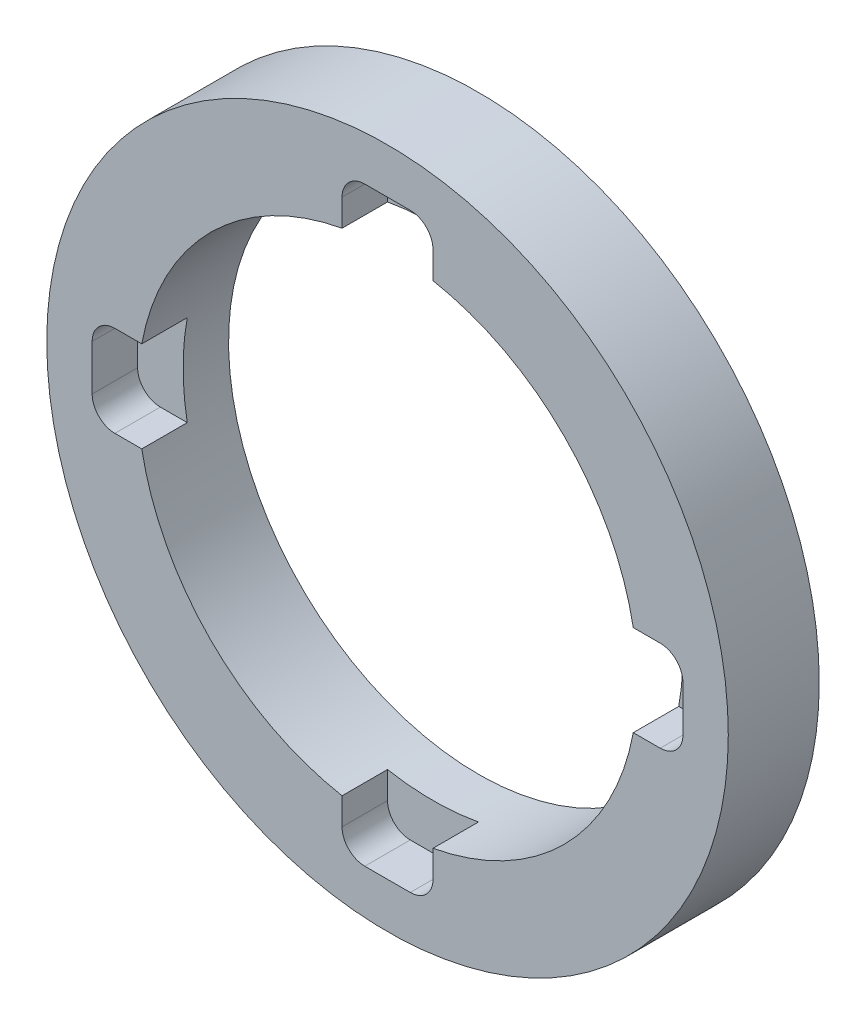
ISO-10303-21;
HEADER;
FILE_DESCRIPTION(('STEP AP214'),'2;1');
FILE_NAME('part.step','',(''),(''),'','','');
FILE_SCHEMA(('AUTOMOTIVE_DESIGN { 1 0 10303 214 1 1 1 1 }'));
ENDSEC;
DATA;
#1=APPLICATION_CONTEXT('core data for automotive mechanical design processes');
#2=APPLICATION_PROTOCOL_DEFINITION('international standard','automotive_design',2000,#1);
#3=PRODUCT_CONTEXT('',#1,'mechanical');
#4=PRODUCT('Part','Part','',(#3));
#5=PRODUCT_RELATED_PRODUCT_CATEGORY('part','',(#4));
#6=PRODUCT_DEFINITION_FORMATION('','',#4);
#7=PRODUCT_DEFINITION_CONTEXT('part definition',#1,'design');
#8=PRODUCT_DEFINITION('design','',#6,#7);
#9=PRODUCT_DEFINITION_SHAPE('','',#8);
#10=(LENGTH_UNIT() NAMED_UNIT(*) SI_UNIT(.MILLI.,.METRE.));
#11=(NAMED_UNIT(*) PLANE_ANGLE_UNIT() SI_UNIT($,.RADIAN.));
#12=(NAMED_UNIT(*) SI_UNIT($,.STERADIAN.) SOLID_ANGLE_UNIT());
#13=UNCERTAINTY_MEASURE_WITH_UNIT(LENGTH_MEASURE(1.E-05),#10,'distance_accuracy_value','');
#14=(GEOMETRIC_REPRESENTATION_CONTEXT(3) GLOBAL_UNCERTAINTY_ASSIGNED_CONTEXT((#13)) GLOBAL_UNIT_ASSIGNED_CONTEXT((#10,
#11,#12)) REPRESENTATION_CONTEXT('',''));
#15=CARTESIAN_POINT('',(0.,0.,0.));
#16=DIRECTION('',(0.,0.,1.));
#17=DIRECTION('',(1.,0.,0.));
#18=AXIS2_PLACEMENT_3D('',#15,#16,#17);
#19=CARTESIAN_POINT('',(0.,0.,12.7));
#20=DIRECTION('',(0.,0.,1.));
#21=DIRECTION('',(1.,0.,0.));
#22=AXIS2_PLACEMENT_3D('',#19,#20,#21);
#23=PLANE('',#22);
#24=DIRECTION('',(1.,0.,0.));
#25=VECTOR('',#24,1.);
#26=CARTESIAN_POINT('',(-41.2496,-6.34999999999985,12.7));
#27=LINE('',#26,#25);
#28=CARTESIAN_POINT('',(-38.0746,-6.34999999999987,12.7));
#29=VERTEX_POINT('',#28);
#30=CARTESIAN_POINT('',(-34.3170450382897,-6.34999999999988,12.7));
#31=VERTEX_POINT('',#30);
#32=EDGE_CURVE('E196',#29,#31,#27,.T.);
#33=ORIENTED_EDGE('',*,*,#32,.F.);
#34=CARTESIAN_POINT('',(-38.0746,-3.17499999999987,12.7));
#35=DIRECTION('',(0.,0.,1.));
#36=DIRECTION('',(1.,0.,0.));
#37=AXIS2_PLACEMENT_3D('',#34,#35,#36);
#38=CIRCLE('',#37,3.175);
#39=CARTESIAN_POINT('',(-41.2496,-3.17499999999985,12.7));
#40=VERTEX_POINT('',#39);
#41=EDGE_CURVE('E334',#29,#40,#38,.F.);
#42=ORIENTED_EDGE('',*,*,#41,.T.);
#43=DIRECTION('',(0.,-1.,0.));
#44=VECTOR('',#43,1.);
#45=CARTESIAN_POINT('',(-41.2496,6.35000000000015,12.7));
#46=LINE('',#45,#44);
#47=CARTESIAN_POINT('',(-41.2496,3.17500000000015,12.7));
#48=VERTEX_POINT('',#47);
#49=EDGE_CURVE('E371',#48,#40,#46,.T.);
#50=ORIENTED_EDGE('',*,*,#49,.F.);
#51=CARTESIAN_POINT('',(-38.0746,3.17500000000013,12.7));
#52=DIRECTION('',(0.,0.,1.));
#53=DIRECTION('',(1.,0.,0.));
#54=AXIS2_PLACEMENT_3D('',#51,#52,#53);
#55=CIRCLE('',#54,3.175);
#56=CARTESIAN_POINT('',(-38.0746,6.35000000000013,12.7));
#57=VERTEX_POINT('',#56);
#58=EDGE_CURVE('E332',#48,#57,#55,.F.);
#59=ORIENTED_EDGE('',*,*,#58,.T.);
#60=DIRECTION('',(-1.,0.,0.));
#61=VECTOR('',#60,1.);
#62=CARTESIAN_POINT('',(-41.2496,6.35000000000015,12.7));
#63=LINE('',#62,#61);
#64=CARTESIAN_POINT('',(-34.3170450382896,6.35000000000012,12.7));
#65=VERTEX_POINT('',#64);
#66=EDGE_CURVE('E368',#65,#57,#63,.T.);
#67=ORIENTED_EDGE('',*,*,#66,.F.);
#68=CARTESIAN_POINT('',(0.,0.,12.7));
#69=DIRECTION('',(0.,0.,1.));
#70=DIRECTION('',(1.,0.,0.));
#71=AXIS2_PLACEMENT_3D('',#68,#69,#70);
#72=CIRCLE('',#71,34.8996);
#73=CARTESIAN_POINT('',(-6.35,34.3170450382896,12.7));
#74=VERTEX_POINT('',#73);
#75=EDGE_CURVE('E225',#74,#65,#72,.T.);
#76=ORIENTED_EDGE('',*,*,#75,.F.);
#77=DIRECTION('',(0.,-1.,0.));
#78=VECTOR('',#77,1.);
#79=CARTESIAN_POINT('',(-6.35,-41.2496,12.7));
#80=LINE('',#79,#78);
#81=CARTESIAN_POINT('',(-6.35,38.0746,12.7));
#82=VERTEX_POINT('',#81);
#83=EDGE_CURVE('E387',#82,#74,#80,.T.);
#84=ORIENTED_EDGE('',*,*,#83,.F.);
#85=CARTESIAN_POINT('',(-3.175,38.0746,12.7));
#86=DIRECTION('',(0.,0.,1.));
#87=DIRECTION('',(1.,0.,0.));
#88=AXIS2_PLACEMENT_3D('',#85,#86,#87);
#89=CIRCLE('',#88,3.175);
#90=CARTESIAN_POINT('',(-3.175,41.2496,12.7));
#91=VERTEX_POINT('',#90);
#92=EDGE_CURVE('E299',#82,#91,#89,.F.);
#93=ORIENTED_EDGE('',*,*,#92,.T.);
#94=DIRECTION('',(-1.,0.,0.));
#95=VECTOR('',#94,1.);
#96=CARTESIAN_POINT('',(-6.35,41.2496,12.7));
#97=LINE('',#96,#95);
#98=CARTESIAN_POINT('',(3.175,41.2496,12.7));
#99=VERTEX_POINT('',#98);
#100=EDGE_CURVE('E384',#99,#91,#97,.T.);
#101=ORIENTED_EDGE('',*,*,#100,.F.);
#102=CARTESIAN_POINT('',(3.175,38.0746,12.7));
#103=DIRECTION('',(0.,0.,1.));
#104=DIRECTION('',(1.,0.,0.));
#105=AXIS2_PLACEMENT_3D('',#102,#103,#104);
#106=CIRCLE('',#105,3.175);
#107=CARTESIAN_POINT('',(6.35,38.0746,12.7));
#108=VERTEX_POINT('',#107);
#109=EDGE_CURVE('E297',#99,#108,#106,.F.);
#110=ORIENTED_EDGE('',*,*,#109,.T.);
#111=DIRECTION('',(0.,1.,0.));
#112=VECTOR('',#111,1.);
#113=CARTESIAN_POINT('',(6.35,-41.2496,12.7));
#114=LINE('',#113,#112);
#115=CARTESIAN_POINT('',(6.35,34.3170450382896,12.7));
#116=VERTEX_POINT('',#115);
#117=EDGE_CURVE('E365',#116,#108,#114,.T.);
#118=ORIENTED_EDGE('',*,*,#117,.F.);
#119=CARTESIAN_POINT('',(34.3170450382897,6.34999999999988,12.7));
#120=VERTEX_POINT('',#119);
#121=EDGE_CURVE('E228',#120,#116,#72,.T.);
#122=ORIENTED_EDGE('',*,*,#121,.F.);
#123=CARTESIAN_POINT('',(38.0746,6.34999999999987,12.7));
#124=VERTEX_POINT('',#123);
#125=EDGE_CURVE('E369',#124,#120,#63,.T.);
#126=ORIENTED_EDGE('',*,*,#125,.F.);
#127=CARTESIAN_POINT('',(38.0746,3.17499999999987,12.7));
#128=DIRECTION('',(0.,0.,1.));
#129=DIRECTION('',(1.,0.,0.));
#130=AXIS2_PLACEMENT_3D('',#127,#128,#129);
#131=CIRCLE('',#130,3.175);
#132=CARTESIAN_POINT('',(41.2496,3.17499999999986,12.7));
#133=VERTEX_POINT('',#132);
#134=EDGE_CURVE('E11',#124,#133,#131,.F.);
#135=ORIENTED_EDGE('',*,*,#134,.T.);
#136=DIRECTION('',(0.,1.,0.));
#137=VECTOR('',#136,1.);
#138=CARTESIAN_POINT('',(41.2496,6.34999999999986,12.7));
#139=LINE('',#138,#137);
#140=CARTESIAN_POINT('',(41.2496,-3.17500000000014,12.7));
#141=VERTEX_POINT('',#140);
#142=EDGE_CURVE('E206',#141,#133,#139,.T.);
#143=ORIENTED_EDGE('',*,*,#142,.F.);
#144=CARTESIAN_POINT('',(38.0746,-3.17500000000013,12.7));
#145=DIRECTION('',(0.,0.,1.));
#146=DIRECTION('',(1.,0.,0.));
#147=AXIS2_PLACEMENT_3D('',#144,#145,#146);
#148=CIRCLE('',#147,3.175);
#149=CARTESIAN_POINT('',(38.0746,-6.35000000000013,12.7));
#150=VERTEX_POINT('',#149);
#151=EDGE_CURVE('E42',#141,#150,#148,.F.);
#152=ORIENTED_EDGE('',*,*,#151,.T.);
#153=CARTESIAN_POINT('',(34.3170450382896,-6.35000000000012,12.7));
#154=VERTEX_POINT('',#153);
#155=EDGE_CURVE('E207',#154,#150,#27,.T.);
#156=ORIENTED_EDGE('',*,*,#155,.F.);
#157=CARTESIAN_POINT('',(6.35,-34.3170450382896,12.7));
#158=VERTEX_POINT('',#157);
#159=EDGE_CURVE('E226',#158,#154,#72,.T.);
#160=ORIENTED_EDGE('',*,*,#159,.F.);
#161=CARTESIAN_POINT('',(6.35,-38.0746,12.7));
#162=VERTEX_POINT('',#161);
#163=EDGE_CURVE('E382',#162,#158,#114,.T.);
#164=ORIENTED_EDGE('',*,*,#163,.F.);
#165=CARTESIAN_POINT('',(3.175,-38.0746,12.7));
#166=DIRECTION('',(0.,0.,1.));
#167=DIRECTION('',(1.,0.,0.));
#168=AXIS2_PLACEMENT_3D('',#165,#166,#167);
#169=CIRCLE('',#168,3.175);
#170=CARTESIAN_POINT('',(3.175,-41.2496,12.7));
#171=VERTEX_POINT('',#170);
#172=EDGE_CURVE('E295',#162,#171,#169,.F.);
#173=ORIENTED_EDGE('',*,*,#172,.T.);
#174=DIRECTION('',(1.,0.,0.));
#175=VECTOR('',#174,1.);
#176=CARTESIAN_POINT('',(-6.35,-41.2496,12.7));
#177=LINE('',#176,#175);
#178=CARTESIAN_POINT('',(-3.175,-41.2496,12.7));
#179=VERTEX_POINT('',#178);
#180=EDGE_CURVE('E388',#179,#171,#177,.T.);
#181=ORIENTED_EDGE('',*,*,#180,.F.);
#182=CARTESIAN_POINT('',(-3.175,-38.0746,12.7));
#183=DIRECTION('',(0.,0.,1.));
#184=DIRECTION('',(1.,0.,0.));
#185=AXIS2_PLACEMENT_3D('',#182,#183,#184);
#186=CIRCLE('',#185,3.175);
#187=CARTESIAN_POINT('',(-6.35,-38.0746,12.7));
#188=VERTEX_POINT('',#187);
#189=EDGE_CURVE('E293',#179,#188,#186,.F.);
#190=ORIENTED_EDGE('',*,*,#189,.T.);
#191=CARTESIAN_POINT('',(-6.35,-34.3170450382896,12.7));
#192=VERTEX_POINT('',#191);
#193=EDGE_CURVE('E224',#192,#188,#80,.T.);
#194=ORIENTED_EDGE('',*,*,#193,.F.);
#195=EDGE_CURVE('E214',#31,#192,#72,.T.);
#196=ORIENTED_EDGE('',*,*,#195,.F.);
#197=EDGE_LOOP('',(#33,#42,#50,#59,#67,#76,#84,#93,#101,#110,#118,#122,#126,#135,#143,#152,#156,
#160,#164,#173,#181,#190,#194,#196));
#198=FACE_BOUND('',#197,.T.);
#199=CARTESIAN_POINT('',(0.,0.,12.7));
#200=DIRECTION('',(0.,0.,1.));
#201=DIRECTION('',(1.,0.,0.));
#202=AXIS2_PLACEMENT_3D('',#199,#200,#201);
#203=CIRCLE('',#202,47.5869);
#204=CARTESIAN_POINT('',(47.5869,0.,12.7));
#205=VERTEX_POINT('',#204);
#206=EDGE_CURVE('E247',#205,#205,#203,.T.);
#207=ORIENTED_EDGE('',*,*,#206,.T.);
#208=EDGE_LOOP('',(#207));
#209=FACE_BOUND('',#208,.T.);
#210=ADVANCED_FACE('F34',(#198,#209),#23,.T.);
#211=CARTESIAN_POINT('',(0.,0.,0.));
#212=DIRECTION('',(0.,0.,1.));
#213=DIRECTION('',(1.,0.,0.));
#214=AXIS2_PLACEMENT_3D('',#211,#212,#213);
#215=PLANE('',#214);
#216=CARTESIAN_POINT('',(0.,0.,0.));
#217=DIRECTION('',(0.,0.,1.));
#218=DIRECTION('',(1.,0.,0.));
#219=AXIS2_PLACEMENT_3D('',#216,#217,#218);
#220=CIRCLE('',#219,47.5869);
#221=CARTESIAN_POINT('',(47.5869,0.,0.));
#222=VERTEX_POINT('',#221);
#223=EDGE_CURVE('E230',#222,#222,#220,.T.);
#224=ORIENTED_EDGE('',*,*,#223,.F.);
#225=EDGE_LOOP('',(#224));
#226=FACE_BOUND('',#225,.T.);
#227=CARTESIAN_POINT('',(0.,0.,0.));
#228=DIRECTION('',(0.,0.,1.));
#229=DIRECTION('',(1.,0.,0.));
#230=AXIS2_PLACEMENT_3D('',#227,#228,#229);
#231=CIRCLE('',#230,34.8996);
#232=CARTESIAN_POINT('',(34.8996,0.,0.));
#233=VERTEX_POINT('',#232);
#234=EDGE_CURVE('E234',#233,#233,#231,.T.);
#235=ORIENTED_EDGE('',*,*,#234,.T.);
#236=EDGE_LOOP('',(#235));
#237=FACE_BOUND('',#236,.T.);
#238=ADVANCED_FACE('F432',(#226,#237),#215,.F.);
#239=CARTESIAN_POINT('',(0.,0.,12.7));
#240=DIRECTION('',(0.,0.,-1.));
#241=DIRECTION('',(-1.,0.,0.));
#242=AXIS2_PLACEMENT_3D('',#239,#240,#241);
#243=CYLINDRICAL_SURFACE('',#242,47.5869);
#244=ORIENTED_EDGE('',*,*,#206,.F.);
#245=EDGE_LOOP('',(#244));
#246=FACE_BOUND('',#245,.T.);
#247=ORIENTED_EDGE('',*,*,#223,.T.);
#248=EDGE_LOOP('',(#247));
#249=FACE_BOUND('',#248,.T.);
#250=ADVANCED_FACE('F437',(#246,#249),#243,.T.);
#251=CARTESIAN_POINT('',(0.,0.,12.7));
#252=DIRECTION('',(0.,0.,-1.));
#253=DIRECTION('',(-1.,0.,0.));
#254=AXIS2_PLACEMENT_3D('',#251,#252,#253);
#255=CYLINDRICAL_SURFACE('',#254,34.8996);
#256=DIRECTION('',(0.,0.,-1.));
#257=VECTOR('',#256,1.);
#258=CARTESIAN_POINT('',(34.3170450382896,-6.35000000000012,12.7));
#259=LINE('',#258,#257);
#260=CARTESIAN_POINT('',(34.3170450382896,-6.35000000000012,6.35));
#261=VERTEX_POINT('',#260);
#262=EDGE_CURVE('E306',#261,#154,#259,.F.);
#263=ORIENTED_EDGE('',*,*,#262,.F.);
#264=CARTESIAN_POINT('',(0.,0.,6.35));
#265=DIRECTION('',(0.,0.,-1.));
#266=DIRECTION('',(-1.,0.,0.));
#267=AXIS2_PLACEMENT_3D('',#264,#265,#266);
#268=CIRCLE('',#267,34.8996);
#269=CARTESIAN_POINT('',(34.3170450382897,6.34999999999988,6.35));
#270=VERTEX_POINT('',#269);
#271=EDGE_CURVE('E218',#270,#261,#268,.T.);
#272=ORIENTED_EDGE('',*,*,#271,.F.);
#273=DIRECTION('',(0.,0.,-1.));
#274=VECTOR('',#273,1.);
#275=CARTESIAN_POINT('',(34.3170450382897,6.34999999999988,12.7));
#276=LINE('',#275,#274);
#277=EDGE_CURVE('E303',#120,#270,#276,.T.);
#278=ORIENTED_EDGE('',*,*,#277,.F.);
#279=ORIENTED_EDGE('',*,*,#121,.T.);
#280=DIRECTION('',(0.,0.,-1.));
#281=VECTOR('',#280,1.);
#282=CARTESIAN_POINT('',(6.35,34.3170450382896,12.7));
#283=LINE('',#282,#281);
#284=CARTESIAN_POINT('',(6.35,34.3170450382896,6.35));
#285=VERTEX_POINT('',#284);
#286=EDGE_CURVE('E263',#285,#116,#283,.F.);
#287=ORIENTED_EDGE('',*,*,#286,.F.);
#288=CARTESIAN_POINT('',(0.,0.,6.35));
#289=DIRECTION('',(0.,0.,-1.));
#290=DIRECTION('',(-1.,0.,0.));
#291=AXIS2_PLACEMENT_3D('',#288,#289,#290);
#292=CIRCLE('',#291,34.8996);
#293=CARTESIAN_POINT('',(-6.35,34.3170450382896,6.35));
#294=VERTEX_POINT('',#293);
#295=EDGE_CURVE('E255',#294,#285,#292,.T.);
#296=ORIENTED_EDGE('',*,*,#295,.F.);
#297=DIRECTION('',(0.,0.,-1.));
#298=VECTOR('',#297,1.);
#299=CARTESIAN_POINT('',(-6.35,34.3170450382896,12.7));
#300=LINE('',#299,#298);
#301=EDGE_CURVE('E260',#74,#294,#300,.T.);
#302=ORIENTED_EDGE('',*,*,#301,.F.);
#303=ORIENTED_EDGE('',*,*,#75,.T.);
#304=DIRECTION('',(0.,0.,-1.));
#305=VECTOR('',#304,1.);
#306=CARTESIAN_POINT('',(-34.3170450382896,6.35000000000012,12.7));
#307=LINE('',#306,#305);
#308=CARTESIAN_POINT('',(-34.3170450382896,6.35000000000012,6.35));
#309=VERTEX_POINT('',#308);
#310=EDGE_CURVE('E219',#309,#65,#307,.F.);
#311=ORIENTED_EDGE('',*,*,#310,.F.);
#312=CARTESIAN_POINT('',(-34.3170450382897,-6.34999999999988,6.35));
#313=VERTEX_POINT('',#312);
#314=EDGE_CURVE('E217',#313,#309,#268,.T.);
#315=ORIENTED_EDGE('',*,*,#314,.F.);
#316=DIRECTION('',(0.,0.,-1.));
#317=VECTOR('',#316,1.);
#318=CARTESIAN_POINT('',(-34.3170450382897,-6.34999999999988,12.7));
#319=LINE('',#318,#317);
#320=EDGE_CURVE('E200',#31,#313,#319,.T.);
#321=ORIENTED_EDGE('',*,*,#320,.F.);
#322=ORIENTED_EDGE('',*,*,#195,.T.);
#323=DIRECTION('',(0.,0.,-1.));
#324=VECTOR('',#323,1.);
#325=CARTESIAN_POINT('',(-6.35,-34.3170450382896,12.7));
#326=LINE('',#325,#324);
#327=CARTESIAN_POINT('',(-6.35,-34.3170450382896,6.35));
#328=VERTEX_POINT('',#327);
#329=EDGE_CURVE('E254',#328,#192,#326,.F.);
#330=ORIENTED_EDGE('',*,*,#329,.F.);
#331=CARTESIAN_POINT('',(6.35,-34.3170450382896,6.35));
#332=VERTEX_POINT('',#331);
#333=EDGE_CURVE('E250',#332,#328,#292,.T.);
#334=ORIENTED_EDGE('',*,*,#333,.F.);
#335=DIRECTION('',(0.,0.,-1.));
#336=VECTOR('',#335,1.);
#337=CARTESIAN_POINT('',(6.35,-34.3170450382896,12.7));
#338=LINE('',#337,#336);
#339=EDGE_CURVE('E257',#158,#332,#338,.T.);
#340=ORIENTED_EDGE('',*,*,#339,.F.);
#341=ORIENTED_EDGE('',*,*,#159,.T.);
#342=EDGE_LOOP('',(#263,#272,#278,#279,#287,#296,#302,#303,#311,#315,#321,#322,#330,#334,#340,#341));
#343=FACE_BOUND('',#342,.T.);
#344=ORIENTED_EDGE('',*,*,#234,.F.);
#345=EDGE_LOOP('',(#344));
#346=FACE_BOUND('',#345,.T.);
#347=ADVANCED_FACE('F211',(#343,#346),#255,.F.);
#348=CARTESIAN_POINT('',(6.35,41.2496,6.35));
#349=DIRECTION('',(0.,0.,-1.));
#350=DIRECTION('',(-1.,0.,0.));
#351=AXIS2_PLACEMENT_3D('',#348,#349,#350);
#352=PLANE('',#351);
#353=DIRECTION('',(0.,-1.,0.));
#354=VECTOR('',#353,1.);
#355=CARTESIAN_POINT('',(-6.35,-41.2496,6.35));
#356=LINE('',#355,#354);
#357=CARTESIAN_POINT('',(-6.35,-38.0746,6.35));
#358=VERTEX_POINT('',#357);
#359=EDGE_CURVE('E380',#328,#358,#356,.T.);
#360=ORIENTED_EDGE('',*,*,#359,.T.);
#361=CARTESIAN_POINT('',(-3.175,-38.0746,6.35));
#362=DIRECTION('',(0.,0.,-1.));
#363=DIRECTION('',(-1.,0.,0.));
#364=AXIS2_PLACEMENT_3D('',#361,#362,#363);
#365=CIRCLE('',#364,3.175);
#366=CARTESIAN_POINT('',(-3.175,-41.2496,6.35));
#367=VERTEX_POINT('',#366);
#368=EDGE_CURVE('E274',#358,#367,#365,.F.);
#369=ORIENTED_EDGE('',*,*,#368,.T.);
#370=DIRECTION('',(1.,0.,0.));
#371=VECTOR('',#370,1.);
#372=CARTESIAN_POINT('',(-6.35,-41.2496,6.35));
#373=LINE('',#372,#371);
#374=CARTESIAN_POINT('',(3.175,-41.2496,6.35));
#375=VERTEX_POINT('',#374);
#376=EDGE_CURVE('E240',#367,#375,#373,.T.);
#377=ORIENTED_EDGE('',*,*,#376,.T.);
#378=CARTESIAN_POINT('',(3.175,-38.0746,6.35));
#379=DIRECTION('',(0.,0.,-1.));
#380=DIRECTION('',(-1.,0.,0.));
#381=AXIS2_PLACEMENT_3D('',#378,#379,#380);
#382=CIRCLE('',#381,3.175);
#383=CARTESIAN_POINT('',(6.35,-38.0746,6.35));
#384=VERTEX_POINT('',#383);
#385=EDGE_CURVE('E272',#375,#384,#382,.F.);
#386=ORIENTED_EDGE('',*,*,#385,.T.);
#387=DIRECTION('',(0.,1.,0.));
#388=VECTOR('',#387,1.);
#389=CARTESIAN_POINT('',(6.35,-41.2496,6.35));
#390=LINE('',#389,#388);
#391=EDGE_CURVE('E374',#384,#332,#390,.T.);
#392=ORIENTED_EDGE('',*,*,#391,.T.);
#393=ORIENTED_EDGE('',*,*,#333,.T.);
#394=EDGE_LOOP('',(#360,#369,#377,#386,#392,#393));
#395=FACE_BOUND('',#394,.T.);
#396=ADVANCED_FACE('F522',(#395),#352,.F.);
#397=CARTESIAN_POINT('',(-6.35,-41.2496,6.35));
#398=DIRECTION('',(-1.,0.,0.));
#399=DIRECTION('',(0.,0.,1.));
#400=AXIS2_PLACEMENT_3D('',#397,#398,#399);
#401=PLANE('',#400);
#402=ORIENTED_EDGE('',*,*,#193,.T.);
#403=DIRECTION('',(0.,0.,1.));
#404=VECTOR('',#403,1.);
#405=CARTESIAN_POINT('',(-6.35,-38.0746,6.35));
#406=LINE('',#405,#404);
#407=EDGE_CURVE('E270',#188,#358,#406,.F.);
#408=ORIENTED_EDGE('',*,*,#407,.T.);
#409=ORIENTED_EDGE('',*,*,#359,.F.);
#410=ORIENTED_EDGE('',*,*,#329,.T.);
#411=EDGE_LOOP('',(#402,#408,#409,#410));
#412=FACE_BOUND('',#411,.T.);
#413=ADVANCED_FACE('F588',(#412),#401,.F.);
#414=CARTESIAN_POINT('',(6.35,-41.2496,6.35));
#415=DIRECTION('',(1.,0.,0.));
#416=DIRECTION('',(0.,0.,-1.));
#417=AXIS2_PLACEMENT_3D('',#414,#415,#416);
#418=PLANE('',#417);
#419=ORIENTED_EDGE('',*,*,#391,.F.);
#420=DIRECTION('',(0.,0.,1.));
#421=VECTOR('',#420,1.);
#422=CARTESIAN_POINT('',(6.35,-38.0746,12.7));
#423=LINE('',#422,#421);
#424=EDGE_CURVE('E276',#384,#162,#423,.T.);
#425=ORIENTED_EDGE('',*,*,#424,.T.);
#426=ORIENTED_EDGE('',*,*,#163,.T.);
#427=ORIENTED_EDGE('',*,*,#339,.T.);
#428=EDGE_LOOP('',(#419,#425,#426,#427));
#429=FACE_BOUND('',#428,.T.);
#430=ADVANCED_FACE('F570',(#429),#418,.F.);
#431=CARTESIAN_POINT('',(-6.35,-41.2496,6.35));
#432=DIRECTION('',(0.,-1.,0.));
#433=DIRECTION('',(0.,0.,-1.));
#434=AXIS2_PLACEMENT_3D('',#431,#432,#433);
#435=PLANE('',#434);
#436=ORIENTED_EDGE('',*,*,#376,.F.);
#437=DIRECTION('',(0.,0.,1.));
#438=VECTOR('',#437,1.);
#439=CARTESIAN_POINT('',(-3.175,-41.2496,12.7));
#440=LINE('',#439,#438);
#441=EDGE_CURVE('E267',#367,#179,#440,.T.);
#442=ORIENTED_EDGE('',*,*,#441,.T.);
#443=ORIENTED_EDGE('',*,*,#180,.T.);
#444=DIRECTION('',(0.,0.,1.));
#445=VECTOR('',#444,1.);
#446=CARTESIAN_POINT('',(3.175,-41.2496,6.35));
#447=LINE('',#446,#445);
#448=EDGE_CURVE('E265',#171,#375,#447,.F.);
#449=ORIENTED_EDGE('',*,*,#448,.T.);
#450=EDGE_LOOP('',(#436,#442,#443,#449));
#451=FACE_BOUND('',#450,.T.);
#452=ADVANCED_FACE('F586',(#451),#435,.F.);
#453=CARTESIAN_POINT('',(-6.35,38.0746,6.35));
#454=VERTEX_POINT('',#453);
#455=EDGE_CURVE('E244',#454,#294,#356,.T.);
#456=ORIENTED_EDGE('',*,*,#455,.F.);
#457=DIRECTION('',(0.,0.,1.));
#458=VECTOR('',#457,1.);
#459=CARTESIAN_POINT('',(-6.35,38.0746,12.7));
#460=LINE('',#459,#458);
#461=EDGE_CURVE('E290',#454,#82,#460,.T.);
#462=ORIENTED_EDGE('',*,*,#461,.T.);
#463=ORIENTED_EDGE('',*,*,#83,.T.);
#464=ORIENTED_EDGE('',*,*,#301,.T.);
#465=EDGE_LOOP('',(#456,#462,#463,#464));
#466=FACE_BOUND('',#465,.T.);
#467=ADVANCED_FACE('F419',(#466),#401,.F.);
#468=CARTESIAN_POINT('',(6.35,38.0746,6.35));
#469=VERTEX_POINT('',#468);
#470=EDGE_CURVE('E377',#285,#469,#390,.T.);
#471=ORIENTED_EDGE('',*,*,#470,.T.);
#472=CARTESIAN_POINT('',(3.175,38.0746,6.35));
#473=DIRECTION('',(0.,0.,-1.));
#474=DIRECTION('',(-1.,0.,0.));
#475=AXIS2_PLACEMENT_3D('',#472,#473,#474);
#476=CIRCLE('',#475,3.175);
#477=CARTESIAN_POINT('',(3.175,41.2496,6.35));
#478=VERTEX_POINT('',#477);
#479=EDGE_CURVE('E288',#469,#478,#476,.F.);
#480=ORIENTED_EDGE('',*,*,#479,.T.);
#481=DIRECTION('',(-1.,0.,0.));
#482=VECTOR('',#481,1.);
#483=CARTESIAN_POINT('',(-6.35,41.2496,6.35));
#484=LINE('',#483,#482);
#485=CARTESIAN_POINT('',(-3.175,41.2496,6.35));
#486=VERTEX_POINT('',#485);
#487=EDGE_CURVE('E376',#478,#486,#484,.T.);
#488=ORIENTED_EDGE('',*,*,#487,.T.);
#489=CARTESIAN_POINT('',(-3.175,38.0746,6.35));
#490=DIRECTION('',(0.,0.,-1.));
#491=DIRECTION('',(-1.,0.,0.));
#492=AXIS2_PLACEMENT_3D('',#489,#490,#491);
#493=CIRCLE('',#492,3.175);
#494=EDGE_CURVE('E286',#486,#454,#493,.F.);
#495=ORIENTED_EDGE('',*,*,#494,.T.);
#496=ORIENTED_EDGE('',*,*,#455,.T.);
#497=ORIENTED_EDGE('',*,*,#295,.T.);
#498=EDGE_LOOP('',(#471,#480,#488,#495,#496,#497));
#499=FACE_BOUND('',#498,.T.);
#500=ADVANCED_FACE('F397',(#499),#352,.F.);
#501=ORIENTED_EDGE('',*,*,#117,.T.);
#502=DIRECTION('',(0.,0.,1.));
#503=VECTOR('',#502,1.);
#504=CARTESIAN_POINT('',(6.35,38.0746,6.35));
#505=LINE('',#504,#503);
#506=EDGE_CURVE('E284',#108,#469,#505,.F.);
#507=ORIENTED_EDGE('',*,*,#506,.T.);
#508=ORIENTED_EDGE('',*,*,#470,.F.);
#509=ORIENTED_EDGE('',*,*,#286,.T.);
#510=EDGE_LOOP('',(#501,#507,#508,#509));
#511=FACE_BOUND('',#510,.T.);
#512=ADVANCED_FACE('F421',(#511),#418,.F.);
#513=CARTESIAN_POINT('',(-6.35,41.2496,6.35));
#514=DIRECTION('',(0.,1.,0.));
#515=DIRECTION('',(0.,0.,1.));
#516=AXIS2_PLACEMENT_3D('',#513,#514,#515);
#517=PLANE('',#516);
#518=ORIENTED_EDGE('',*,*,#487,.F.);
#519=DIRECTION('',(0.,0.,1.));
#520=VECTOR('',#519,1.);
#521=CARTESIAN_POINT('',(3.175,41.2496,12.7));
#522=LINE('',#521,#520);
#523=EDGE_CURVE('E281',#478,#99,#522,.T.);
#524=ORIENTED_EDGE('',*,*,#523,.T.);
#525=ORIENTED_EDGE('',*,*,#100,.T.);
#526=DIRECTION('',(0.,0.,1.));
#527=VECTOR('',#526,1.);
#528=CARTESIAN_POINT('',(-3.175,41.2496,6.35));
#529=LINE('',#528,#527);
#530=EDGE_CURVE('E279',#91,#486,#529,.F.);
#531=ORIENTED_EDGE('',*,*,#530,.T.);
#532=EDGE_LOOP('',(#518,#524,#525,#531));
#533=FACE_BOUND('',#532,.T.);
#534=ADVANCED_FACE('F407',(#533),#517,.F.);
#535=CARTESIAN_POINT('',(-3.175,-38.0746,6.35));
#536=DIRECTION('',(0.,0.,-1.));
#537=DIRECTION('',(-1.,0.,0.));
#538=AXIS2_PLACEMENT_3D('',#535,#536,#537);
#539=CYLINDRICAL_SURFACE('',#538,3.175);
#540=ORIENTED_EDGE('',*,*,#368,.F.);
#541=ORIENTED_EDGE('',*,*,#407,.F.);
#542=ORIENTED_EDGE('',*,*,#189,.F.);
#543=ORIENTED_EDGE('',*,*,#441,.F.);
#544=EDGE_LOOP('',(#540,#541,#542,#543));
#545=FACE_BOUND('',#544,.T.);
#546=ADVANCED_FACE('F446',(#545),#539,.F.);
#547=CARTESIAN_POINT('',(3.175,-38.0746,6.35));
#548=DIRECTION('',(0.,0.,-1.));
#549=DIRECTION('',(-1.,0.,0.));
#550=AXIS2_PLACEMENT_3D('',#547,#548,#549);
#551=CYLINDRICAL_SURFACE('',#550,3.175);
#552=ORIENTED_EDGE('',*,*,#385,.F.);
#553=ORIENTED_EDGE('',*,*,#448,.F.);
#554=ORIENTED_EDGE('',*,*,#172,.F.);
#555=ORIENTED_EDGE('',*,*,#424,.F.);
#556=EDGE_LOOP('',(#552,#553,#554,#555));
#557=FACE_BOUND('',#556,.T.);
#558=ADVANCED_FACE('F449',(#557),#551,.F.);
#559=CARTESIAN_POINT('',(3.175,38.0746,6.35));
#560=DIRECTION('',(0.,0.,-1.));
#561=DIRECTION('',(-1.,0.,0.));
#562=AXIS2_PLACEMENT_3D('',#559,#560,#561);
#563=CYLINDRICAL_SURFACE('',#562,3.175);
#564=ORIENTED_EDGE('',*,*,#479,.F.);
#565=ORIENTED_EDGE('',*,*,#506,.F.);
#566=ORIENTED_EDGE('',*,*,#109,.F.);
#567=ORIENTED_EDGE('',*,*,#523,.F.);
#568=EDGE_LOOP('',(#564,#565,#566,#567));
#569=FACE_BOUND('',#568,.T.);
#570=ADVANCED_FACE('F404',(#569),#563,.F.);
#571=CARTESIAN_POINT('',(-3.175,38.0746,6.35));
#572=DIRECTION('',(0.,0.,-1.));
#573=DIRECTION('',(-1.,0.,0.));
#574=AXIS2_PLACEMENT_3D('',#571,#572,#573);
#575=CYLINDRICAL_SURFACE('',#574,3.175);
#576=ORIENTED_EDGE('',*,*,#494,.F.);
#577=ORIENTED_EDGE('',*,*,#530,.F.);
#578=ORIENTED_EDGE('',*,*,#92,.F.);
#579=ORIENTED_EDGE('',*,*,#461,.F.);
#580=EDGE_LOOP('',(#576,#577,#578,#579));
#581=FACE_BOUND('',#580,.T.);
#582=ADVANCED_FACE('F416',(#581),#575,.F.);
#583=CARTESIAN_POINT('',(41.2496,-6.35000000000014,6.35));
#584=DIRECTION('',(0.,0.,-1.));
#585=DIRECTION('',(0.,1.,0.));
#586=AXIS2_PLACEMENT_3D('',#583,#584,#585);
#587=PLANE('',#586);
#588=DIRECTION('',(-1.,0.,0.));
#589=VECTOR('',#588,1.);
#590=CARTESIAN_POINT('',(-41.2496,6.35000000000015,6.35));
#591=LINE('',#590,#589);
#592=CARTESIAN_POINT('',(-38.0746,6.35000000000013,6.35));
#593=VERTEX_POINT('',#592);
#594=EDGE_CURVE('E355',#309,#593,#591,.T.);
#595=ORIENTED_EDGE('',*,*,#594,.T.);
#596=CARTESIAN_POINT('',(-38.0746,3.17500000000013,6.35));
#597=DIRECTION('',(0.,0.,-1.));
#598=DIRECTION('',(-1.,0.,0.));
#599=AXIS2_PLACEMENT_3D('',#596,#597,#598);
#600=CIRCLE('',#599,3.175);
#601=CARTESIAN_POINT('',(-41.2496,3.17500000000015,6.35));
#602=VERTEX_POINT('',#601);
#603=EDGE_CURVE('E317',#593,#602,#600,.F.);
#604=ORIENTED_EDGE('',*,*,#603,.T.);
#605=DIRECTION('',(0.,-1.,0.));
#606=VECTOR('',#605,1.);
#607=CARTESIAN_POINT('',(-41.2496,6.35000000000015,6.35));
#608=LINE('',#607,#606);
#609=CARTESIAN_POINT('',(-41.2496,-3.17499999999985,6.35));
#610=VERTEX_POINT('',#609);
#611=EDGE_CURVE('E363',#602,#610,#608,.T.);
#612=ORIENTED_EDGE('',*,*,#611,.T.);
#613=CARTESIAN_POINT('',(-38.0746,-3.17499999999987,6.35));
#614=DIRECTION('',(0.,0.,-1.));
#615=DIRECTION('',(-1.,0.,0.));
#616=AXIS2_PLACEMENT_3D('',#613,#614,#615);
#617=CIRCLE('',#616,3.175);
#618=CARTESIAN_POINT('',(-38.0746,-6.34999999999987,6.35));
#619=VERTEX_POINT('',#618);
#620=EDGE_CURVE('E315',#610,#619,#617,.F.);
#621=ORIENTED_EDGE('',*,*,#620,.T.);
#622=DIRECTION('',(1.,0.,0.));
#623=VECTOR('',#622,1.);
#624=CARTESIAN_POINT('',(-41.2496,-6.34999999999985,6.35));
#625=LINE('',#624,#623);
#626=EDGE_CURVE('E356',#619,#313,#625,.T.);
#627=ORIENTED_EDGE('',*,*,#626,.T.);
#628=ORIENTED_EDGE('',*,*,#314,.T.);
#629=EDGE_LOOP('',(#595,#604,#612,#621,#627,#628));
#630=FACE_BOUND('',#629,.T.);
#631=ADVANCED_FACE('F458',(#630),#587,.F.);
#632=CARTESIAN_POINT('',(-41.2496,6.35000000000015,6.35));
#633=DIRECTION('',(0.,1.,0.));
#634=DIRECTION('',(-1.,0.,0.));
#635=AXIS2_PLACEMENT_3D('',#632,#633,#634);
#636=PLANE('',#635);
#637=ORIENTED_EDGE('',*,*,#66,.T.);
#638=DIRECTION('',(0.,0.,1.));
#639=VECTOR('',#638,1.);
#640=CARTESIAN_POINT('',(-38.0746,6.35000000000013,6.35));
#641=LINE('',#640,#639);
#642=EDGE_CURVE('E313',#57,#593,#641,.F.);
#643=ORIENTED_EDGE('',*,*,#642,.T.);
#644=ORIENTED_EDGE('',*,*,#594,.F.);
#645=ORIENTED_EDGE('',*,*,#310,.T.);
#646=EDGE_LOOP('',(#637,#643,#644,#645));
#647=FACE_BOUND('',#646,.T.);
#648=ADVANCED_FACE('F480',(#647),#636,.F.);
#649=CARTESIAN_POINT('',(-41.2496,-6.34999999999985,6.35));
#650=DIRECTION('',(0.,-1.,0.));
#651=DIRECTION('',(1.,0.,0.));
#652=AXIS2_PLACEMENT_3D('',#649,#650,#651);
#653=PLANE('',#652);
#654=ORIENTED_EDGE('',*,*,#626,.F.);
#655=DIRECTION('',(0.,0.,1.));
#656=VECTOR('',#655,1.);
#657=CARTESIAN_POINT('',(-38.0746,-6.34999999999987,12.7));
#658=LINE('',#657,#656);
#659=EDGE_CURVE('E203',#619,#29,#658,.T.);
#660=ORIENTED_EDGE('',*,*,#659,.T.);
#661=ORIENTED_EDGE('',*,*,#32,.T.);
#662=ORIENTED_EDGE('',*,*,#320,.T.);
#663=EDGE_LOOP('',(#654,#660,#661,#662));
#664=FACE_BOUND('',#663,.T.);
#665=ADVANCED_FACE('F199',(#664),#653,.F.);
#666=CARTESIAN_POINT('',(-41.2496,6.35000000000015,6.35));
#667=DIRECTION('',(-1.,0.,0.));
#668=DIRECTION('',(0.,-1.,0.));
#669=AXIS2_PLACEMENT_3D('',#666,#667,#668);
#670=PLANE('',#669);
#671=ORIENTED_EDGE('',*,*,#611,.F.);
#672=DIRECTION('',(0.,0.,1.));
#673=VECTOR('',#672,1.);
#674=CARTESIAN_POINT('',(-41.2496,3.17500000000015,12.7));
#675=LINE('',#674,#673);
#676=EDGE_CURVE('E310',#602,#48,#675,.T.);
#677=ORIENTED_EDGE('',*,*,#676,.T.);
#678=ORIENTED_EDGE('',*,*,#49,.T.);
#679=DIRECTION('',(0.,0.,1.));
#680=VECTOR('',#679,1.);
#681=CARTESIAN_POINT('',(-41.2496,-3.17499999999985,6.35));
#682=LINE('',#681,#680);
#683=EDGE_CURVE('E308',#40,#610,#682,.F.);
#684=ORIENTED_EDGE('',*,*,#683,.T.);
#685=EDGE_LOOP('',(#671,#677,#678,#684));
#686=FACE_BOUND('',#685,.T.);
#687=ADVANCED_FACE('F474',(#686),#670,.F.);
#688=CARTESIAN_POINT('',(38.0746,6.34999999999987,6.35));
#689=VERTEX_POINT('',#688);
#690=EDGE_CURVE('E359',#689,#270,#591,.T.);
#691=ORIENTED_EDGE('',*,*,#690,.F.);
#692=DIRECTION('',(0.,0.,1.));
#693=VECTOR('',#692,1.);
#694=CARTESIAN_POINT('',(38.0746,6.34999999999987,12.7));
#695=LINE('',#694,#693);
#696=EDGE_CURVE('E330',#689,#124,#695,.T.);
#697=ORIENTED_EDGE('',*,*,#696,.T.);
#698=ORIENTED_EDGE('',*,*,#125,.T.);
#699=ORIENTED_EDGE('',*,*,#277,.T.);
#700=EDGE_LOOP('',(#691,#697,#698,#699));
#701=FACE_BOUND('',#700,.T.);
#702=ADVANCED_FACE('F424',(#701),#636,.F.);
#703=CARTESIAN_POINT('',(38.0746,-6.35000000000013,6.35));
#704=VERTEX_POINT('',#703);
#705=EDGE_CURVE('E352',#261,#704,#625,.T.);
#706=ORIENTED_EDGE('',*,*,#705,.T.);
#707=CARTESIAN_POINT('',(38.0746,-3.17500000000013,6.35));
#708=DIRECTION('',(0.,0.,-1.));
#709=DIRECTION('',(-1.,0.,0.));
#710=AXIS2_PLACEMENT_3D('',#707,#708,#709);
#711=CIRCLE('',#710,3.175);
#712=CARTESIAN_POINT('',(41.2496,-3.17500000000014,6.35));
#713=VERTEX_POINT('',#712);
#714=EDGE_CURVE('E328',#704,#713,#711,.F.);
#715=ORIENTED_EDGE('',*,*,#714,.T.);
#716=DIRECTION('',(0.,1.,0.));
#717=VECTOR('',#716,1.);
#718=CARTESIAN_POINT('',(41.2496,6.34999999999986,6.35));
#719=LINE('',#718,#717);
#720=CARTESIAN_POINT('',(41.2496,3.17499999999986,6.35));
#721=VERTEX_POINT('',#720);
#722=EDGE_CURVE('E351',#713,#721,#719,.T.);
#723=ORIENTED_EDGE('',*,*,#722,.T.);
#724=CARTESIAN_POINT('',(38.0746,3.17499999999987,6.35));
#725=DIRECTION('',(0.,0.,-1.));
#726=DIRECTION('',(-1.,0.,0.));
#727=AXIS2_PLACEMENT_3D('',#724,#725,#726);
#728=CIRCLE('',#727,3.175);
#729=EDGE_CURVE('E55',#721,#689,#728,.F.);
#730=ORIENTED_EDGE('',*,*,#729,.T.);
#731=ORIENTED_EDGE('',*,*,#690,.T.);
#732=ORIENTED_EDGE('',*,*,#271,.T.);
#733=EDGE_LOOP('',(#706,#715,#723,#730,#731,#732));
#734=FACE_BOUND('',#733,.T.);
#735=ADVANCED_FACE('F350',(#734),#587,.F.);
#736=ORIENTED_EDGE('',*,*,#155,.T.);
#737=DIRECTION('',(0.,0.,1.));
#738=VECTOR('',#737,1.);
#739=CARTESIAN_POINT('',(38.0746,-6.35000000000013,6.35));
#740=LINE('',#739,#738);
#741=EDGE_CURVE('E325',#150,#704,#740,.F.);
#742=ORIENTED_EDGE('',*,*,#741,.T.);
#743=ORIENTED_EDGE('',*,*,#705,.F.);
#744=ORIENTED_EDGE('',*,*,#262,.T.);
#745=EDGE_LOOP('',(#736,#742,#743,#744));
#746=FACE_BOUND('',#745,.T.);
#747=ADVANCED_FACE('F344',(#746),#653,.F.);
#748=CARTESIAN_POINT('',(41.2496,6.34999999999986,6.35));
#749=DIRECTION('',(1.,0.,0.));
#750=DIRECTION('',(0.,1.,0.));
#751=AXIS2_PLACEMENT_3D('',#748,#749,#750);
#752=PLANE('',#751);
#753=ORIENTED_EDGE('',*,*,#722,.F.);
#754=DIRECTION('',(0.,0.,1.));
#755=VECTOR('',#754,1.);
#756=CARTESIAN_POINT('',(41.2496,-3.17500000000014,12.7));
#757=LINE('',#756,#755);
#758=EDGE_CURVE('E322',#713,#141,#757,.T.);
#759=ORIENTED_EDGE('',*,*,#758,.T.);
#760=ORIENTED_EDGE('',*,*,#142,.T.);
#761=DIRECTION('',(0.,0.,1.));
#762=VECTOR('',#761,1.);
#763=CARTESIAN_POINT('',(41.2496,3.17499999999986,6.35));
#764=LINE('',#763,#762);
#765=EDGE_CURVE('E320',#133,#721,#764,.F.);
#766=ORIENTED_EDGE('',*,*,#765,.T.);
#767=EDGE_LOOP('',(#753,#759,#760,#766));
#768=FACE_BOUND('',#767,.T.);
#769=ADVANCED_FACE('F354',(#768),#752,.F.);
#770=CARTESIAN_POINT('',(-38.0746,3.17500000000013,6.35));
#771=DIRECTION('',(0.,0.,-1.));
#772=DIRECTION('',(-1.,0.,0.));
#773=AXIS2_PLACEMENT_3D('',#770,#771,#772);
#774=CYLINDRICAL_SURFACE('',#773,3.175);
#775=ORIENTED_EDGE('',*,*,#603,.F.);
#776=ORIENTED_EDGE('',*,*,#642,.F.);
#777=ORIENTED_EDGE('',*,*,#58,.F.);
#778=ORIENTED_EDGE('',*,*,#676,.F.);
#779=EDGE_LOOP('',(#775,#776,#777,#778));
#780=FACE_BOUND('',#779,.T.);
#781=ADVANCED_FACE('F459',(#780),#774,.F.);
#782=CARTESIAN_POINT('',(-38.0746,-3.17499999999987,6.35));
#783=DIRECTION('',(0.,0.,-1.));
#784=DIRECTION('',(-1.,0.,0.));
#785=AXIS2_PLACEMENT_3D('',#782,#783,#784);
#786=CYLINDRICAL_SURFACE('',#785,3.175);
#787=ORIENTED_EDGE('',*,*,#620,.F.);
#788=ORIENTED_EDGE('',*,*,#683,.F.);
#789=ORIENTED_EDGE('',*,*,#41,.F.);
#790=ORIENTED_EDGE('',*,*,#659,.F.);
#791=EDGE_LOOP('',(#787,#788,#789,#790));
#792=FACE_BOUND('',#791,.T.);
#793=ADVANCED_FACE('F430',(#792),#786,.F.);
#794=CARTESIAN_POINT('',(38.0746,-3.17500000000013,6.35));
#795=DIRECTION('',(0.,0.,-1.));
#796=DIRECTION('',(-1.,0.,0.));
#797=AXIS2_PLACEMENT_3D('',#794,#795,#796);
#798=CYLINDRICAL_SURFACE('',#797,3.175);
#799=ORIENTED_EDGE('',*,*,#714,.F.);
#800=ORIENTED_EDGE('',*,*,#741,.F.);
#801=ORIENTED_EDGE('',*,*,#151,.F.);
#802=ORIENTED_EDGE('',*,*,#758,.F.);
#803=EDGE_LOOP('',(#799,#800,#801,#802));
#804=FACE_BOUND('',#803,.T.);
#805=ADVANCED_FACE('F348',(#804),#798,.F.);
#806=CARTESIAN_POINT('',(38.0746,3.17499999999987,6.35));
#807=DIRECTION('',(0.,0.,-1.));
#808=DIRECTION('',(-1.,0.,0.));
#809=AXIS2_PLACEMENT_3D('',#806,#807,#808);
#810=CYLINDRICAL_SURFACE('',#809,3.175);
#811=ORIENTED_EDGE('',*,*,#729,.F.);
#812=ORIENTED_EDGE('',*,*,#765,.F.);
#813=ORIENTED_EDGE('',*,*,#134,.F.);
#814=ORIENTED_EDGE('',*,*,#696,.F.);
#815=EDGE_LOOP('',(#811,#812,#813,#814));
#816=FACE_BOUND('',#815,.T.);
#817=ADVANCED_FACE('F36',(#816),#810,.F.);
#818=CLOSED_SHELL('',(#210,#238,#250,#347,#396,#413,#430,#452,#467,#500,#512,#534,#546,#558,
#570,#582,#631,#648,#665,#687,#702,#735,#747,#769,#781,#793,#805,#817));
#819=MANIFOLD_SOLID_BREP('B2',#818);
#820=ADVANCED_BREP_SHAPE_REPRESENTATION('',(#18,#819),#14);
#821=SHAPE_DEFINITION_REPRESENTATION(#9,#820);
ENDSEC;
END-ISO-10303-21;
